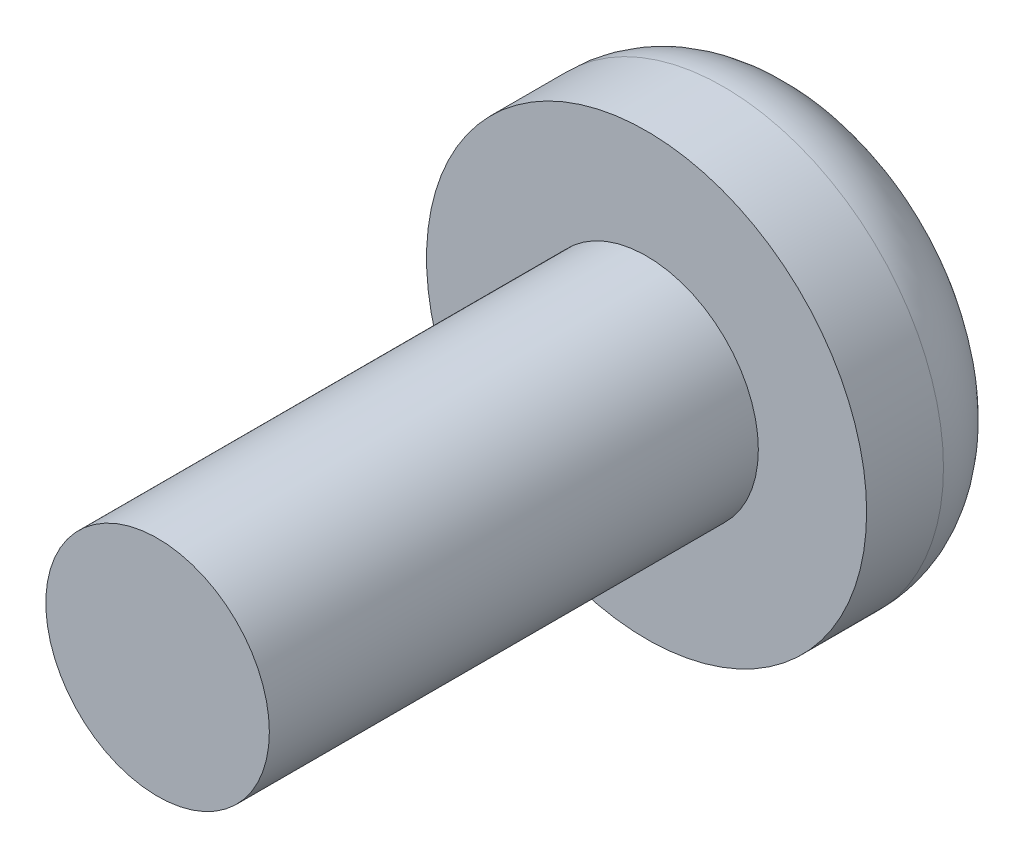
ISO-10303-21;
HEADER;
FILE_DESCRIPTION(('STEP AP214'),'2;1');
FILE_NAME('part.step','',(''),(''),'','','');
FILE_SCHEMA(('AUTOMOTIVE_DESIGN { 1 0 10303 214 1 1 1 1 }'));
ENDSEC;
DATA;
#1=APPLICATION_CONTEXT('core data for automotive mechanical design processes');
#2=APPLICATION_PROTOCOL_DEFINITION('international standard','automotive_design',2000,#1);
#3=PRODUCT_CONTEXT('',#1,'mechanical');
#4=PRODUCT('Part','Part','',(#3));
#5=PRODUCT_RELATED_PRODUCT_CATEGORY('part','',(#4));
#6=PRODUCT_DEFINITION_FORMATION('','',#4);
#7=PRODUCT_DEFINITION_CONTEXT('part definition',#1,'design');
#8=PRODUCT_DEFINITION('design','',#6,#7);
#9=PRODUCT_DEFINITION_SHAPE('','',#8);
#10=(LENGTH_UNIT() NAMED_UNIT(*) SI_UNIT(.MILLI.,.METRE.));
#11=(NAMED_UNIT(*) PLANE_ANGLE_UNIT() SI_UNIT($,.RADIAN.));
#12=(NAMED_UNIT(*) SI_UNIT($,.STERADIAN.) SOLID_ANGLE_UNIT());
#13=UNCERTAINTY_MEASURE_WITH_UNIT(LENGTH_MEASURE(1.E-05),#10,'distance_accuracy_value','');
#14=(GEOMETRIC_REPRESENTATION_CONTEXT(3) GLOBAL_UNCERTAINTY_ASSIGNED_CONTEXT((#13)) GLOBAL_UNIT_ASSIGNED_CONTEXT((#10,
#11,#12)) REPRESENTATION_CONTEXT('',''));
#15=CARTESIAN_POINT('',(0.,0.,0.));
#16=DIRECTION('',(0.,0.,1.));
#17=DIRECTION('',(1.,0.,0.));
#18=AXIS2_PLACEMENT_3D('',#15,#16,#17);
#19=CARTESIAN_POINT('',(0.,0.,0.));
#20=DIRECTION('',(0.,0.,1.));
#21=DIRECTION('',(1.,0.,0.));
#22=AXIS2_PLACEMENT_3D('',#19,#20,#21);
#23=PLANE('',#22);
#24=DIRECTION('',(1.,0.,0.));
#25=VECTOR('',#24,1.);
#26=CARTESIAN_POINT('',(-2.457284940462,0.307900911623638,0.));
#27=LINE('',#26,#25);
#28=CARTESIAN_POINT('',(0.307900911623639,0.307900911623638,0.));
#29=VERTEX_POINT('',#28);
#30=CARTESIAN_POINT('',(2.457284940462,0.307900911623638,0.));
#31=VERTEX_POINT('',#30);
#32=EDGE_CURVE('E202',#29,#31,#27,.T.);
#33=ORIENTED_EDGE('',*,*,#32,.F.);
#34=DIRECTION('',(0.,-1.,0.));
#35=VECTOR('',#34,1.);
#36=CARTESIAN_POINT('',(0.307900911623646,2.457284940462,0.));
#37=LINE('',#36,#35);
#38=CARTESIAN_POINT('',(0.307900911623646,2.457284940462,0.));
#39=VERTEX_POINT('',#38);
#40=EDGE_CURVE('E149',#39,#29,#37,.T.);
#41=ORIENTED_EDGE('',*,*,#40,.F.);
#42=CARTESIAN_POINT('',(0.,0.,0.));
#43=DIRECTION('',(0.,0.,1.));
#44=DIRECTION('',(1.,0.,0.));
#45=AXIS2_PLACEMENT_3D('',#42,#43,#44);
#46=CIRCLE('',#45,2.4765);
#47=EDGE_CURVE('E44',#39,#31,#46,.F.);
#48=ORIENTED_EDGE('',*,*,#47,.T.);
#49=EDGE_LOOP('',(#33,#41,#48));
#50=FACE_BOUND('',#49,.T.);
#51=ADVANCED_FACE('F35',(#50),#23,.F.);
#52=CARTESIAN_POINT('',(-0.307900911623629,2.457284940462,0.));
#53=VERTEX_POINT('',#52);
#54=EDGE_CURVE('E234',#53,#39,#46,.F.);
#55=ORIENTED_EDGE('',*,*,#54,.T.);
#56=DIRECTION('',(1.,0.,0.));
#57=VECTOR('',#56,1.);
#58=CARTESIAN_POINT('',(0.307900911623646,2.457284940462,0.));
#59=LINE('',#58,#57);
#60=EDGE_CURVE('E160',#53,#39,#59,.T.);
#61=ORIENTED_EDGE('',*,*,#60,.F.);
#62=EDGE_LOOP('',(#55,#61));
#63=FACE_BOUND('',#62,.T.);
#64=ADVANCED_FACE('F249',(#63),#23,.F.);
#65=CARTESIAN_POINT('',(2.457284940462,-0.307900911623636,0.));
#66=VERTEX_POINT('',#65);
#67=CARTESIAN_POINT('',(0.307900911623629,-2.457284940462,0.));
#68=VERTEX_POINT('',#67);
#69=EDGE_CURVE('E11',#66,#68,#46,.F.);
#70=ORIENTED_EDGE('',*,*,#69,.T.);
#71=CARTESIAN_POINT('',(0.307900911623636,-0.307900911623638,0.));
#72=VERTEX_POINT('',#71);
#73=EDGE_CURVE('E151',#72,#68,#37,.T.);
#74=ORIENTED_EDGE('',*,*,#73,.F.);
#75=DIRECTION('',(-1.,0.,0.));
#76=VECTOR('',#75,1.);
#77=CARTESIAN_POINT('',(-2.457284940462,-0.307900911623638,0.));
#78=LINE('',#77,#76);
#79=EDGE_CURVE('E196',#66,#72,#78,.T.);
#80=ORIENTED_EDGE('',*,*,#79,.F.);
#81=EDGE_LOOP('',(#70,#74,#80));
#82=FACE_BOUND('',#81,.T.);
#83=ADVANCED_FACE('F272',(#82),#23,.F.);
#84=CARTESIAN_POINT('',(-0.307900911623646,-2.457284940462,0.));
#85=VERTEX_POINT('',#84);
#86=EDGE_CURVE('E43',#68,#85,#46,.F.);
#87=ORIENTED_EDGE('',*,*,#86,.T.);
#88=DIRECTION('',(-1.,0.,0.));
#89=VECTOR('',#88,1.);
#90=CARTESIAN_POINT('',(0.307900911623629,-2.457284940462,0.));
#91=LINE('',#90,#89);
#92=EDGE_CURVE('E132',#68,#85,#91,.T.);
#93=ORIENTED_EDGE('',*,*,#92,.F.);
#94=EDGE_LOOP('',(#87,#93));
#95=FACE_BOUND('',#94,.T.);
#96=ADVANCED_FACE('F283',(#95),#23,.F.);
#97=CARTESIAN_POINT('',(-2.457284940462,0.307900911623638,1.016));
#98=DIRECTION('',(0.,1.,0.));
#99=DIRECTION('',(0.,0.,1.));
#100=AXIS2_PLACEMENT_3D('',#97,#98,#99);
#101=PLANE('',#100);
#102=DIRECTION('',(1.,0.,0.));
#103=VECTOR('',#102,1.);
#104=CARTESIAN_POINT('',(-2.457284940462,0.307900911623638,1.016));
#105=LINE('',#104,#103);
#106=CARTESIAN_POINT('',(0.307900911623638,0.307900911623638,1.016));
#107=VERTEX_POINT('',#106);
#108=CARTESIAN_POINT('',(2.457284940462,0.307900911623638,1.016));
#109=VERTEX_POINT('',#108);
#110=EDGE_CURVE('E190',#107,#109,#105,.T.);
#111=ORIENTED_EDGE('',*,*,#110,.F.);
#112=DIRECTION('',(0.,0.,-1.));
#113=VECTOR('',#112,1.);
#114=CARTESIAN_POINT('',(0.307900911623639,0.307900911623638,1.016));
#115=LINE('',#114,#113);
#116=EDGE_CURVE('E176',#107,#29,#115,.T.);
#117=ORIENTED_EDGE('',*,*,#116,.T.);
#118=ORIENTED_EDGE('',*,*,#32,.T.);
#119=DIRECTION('',(0.,0.,-1.));
#120=VECTOR('',#119,1.);
#121=CARTESIAN_POINT('',(2.457284940462,0.307900911623638,1.016));
#122=LINE('',#121,#120);
#123=EDGE_CURVE('E205',#109,#31,#122,.T.);
#124=ORIENTED_EDGE('',*,*,#123,.F.);
#125=EDGE_LOOP('',(#111,#117,#118,#124));
#126=FACE_BOUND('',#125,.T.);
#127=ADVANCED_FACE('F288',(#126),#101,.F.);
#128=CARTESIAN_POINT('',(-2.457284940462,-0.307900911623638,1.016));
#129=DIRECTION('',(0.,-1.,0.));
#130=DIRECTION('',(0.,0.,-1.));
#131=AXIS2_PLACEMENT_3D('',#128,#129,#130);
#132=PLANE('',#131);
#133=ORIENTED_EDGE('',*,*,#79,.T.);
#134=DIRECTION('',(0.,0.,1.));
#135=VECTOR('',#134,1.);
#136=CARTESIAN_POINT('',(0.307900911623637,-0.307900911623638,1.016));
#137=LINE('',#136,#135);
#138=CARTESIAN_POINT('',(0.307900911623636,-0.307900911623638,1.016));
#139=VERTEX_POINT('',#138);
#140=EDGE_CURVE('E173',#72,#139,#137,.T.);
#141=ORIENTED_EDGE('',*,*,#140,.T.);
#142=DIRECTION('',(-1.,0.,0.));
#143=VECTOR('',#142,1.);
#144=CARTESIAN_POINT('',(-2.457284940462,-0.307900911623638,1.016));
#145=LINE('',#144,#143);
#146=CARTESIAN_POINT('',(2.457284940462,-0.307900911623638,1.016));
#147=VERTEX_POINT('',#146);
#148=EDGE_CURVE('E185',#147,#139,#145,.T.);
#149=ORIENTED_EDGE('',*,*,#148,.F.);
#150=DIRECTION('',(0.,0.,-1.));
#151=VECTOR('',#150,1.);
#152=CARTESIAN_POINT('',(2.457284940462,-0.307900911623638,1.016));
#153=LINE('',#152,#151);
#154=EDGE_CURVE('E193',#147,#66,#153,.T.);
#155=ORIENTED_EDGE('',*,*,#154,.T.);
#156=EDGE_LOOP('',(#133,#141,#149,#155));
#157=FACE_BOUND('',#156,.T.);
#158=ADVANCED_FACE('F274',(#157),#132,.F.);
#159=EDGE_CURVE('E225',#31,#66,#46,.F.);
#160=ORIENTED_EDGE('',*,*,#159,.T.);
#161=DIRECTION('',(0.,-1.,0.));
#162=VECTOR('',#161,1.);
#163=CARTESIAN_POINT('',(2.457284940462,0.307900911623638,0.));
#164=LINE('',#163,#162);
#165=EDGE_CURVE('E179',#31,#66,#164,.T.);
#166=ORIENTED_EDGE('',*,*,#165,.F.);
#167=EDGE_LOOP('',(#160,#166));
#168=FACE_BOUND('',#167,.T.);
#169=ADVANCED_FACE('F280',(#168),#23,.F.);
#170=CARTESIAN_POINT('',(-2.457284940462,0.307900911623638,0.));
#171=VERTEX_POINT('',#170);
#172=EDGE_CURVE('E229',#171,#53,#46,.F.);
#173=ORIENTED_EDGE('',*,*,#172,.T.);
#174=DIRECTION('',(0.,1.,0.));
#175=VECTOR('',#174,1.);
#176=CARTESIAN_POINT('',(-0.307900911623629,2.457284940462,0.));
#177=LINE('',#176,#175);
#178=CARTESIAN_POINT('',(-0.307900911623636,0.307900911623638,0.));
#179=VERTEX_POINT('',#178);
#180=EDGE_CURVE('E157',#179,#53,#177,.T.);
#181=ORIENTED_EDGE('',*,*,#180,.F.);
#182=EDGE_CURVE('E184',#171,#179,#27,.T.);
#183=ORIENTED_EDGE('',*,*,#182,.F.);
#184=EDGE_LOOP('',(#173,#181,#183));
#185=FACE_BOUND('',#184,.T.);
#186=ADVANCED_FACE('F258',(#185),#23,.F.);
#187=CARTESIAN_POINT('',(-2.457284940462,-0.307900911623638,0.));
#188=VERTEX_POINT('',#187);
#189=EDGE_CURVE('E45',#188,#171,#46,.F.);
#190=ORIENTED_EDGE('',*,*,#189,.T.);
#191=DIRECTION('',(0.,1.,0.));
#192=VECTOR('',#191,1.);
#193=CARTESIAN_POINT('',(-2.457284940462,0.307900911623638,0.));
#194=LINE('',#193,#192);
#195=EDGE_CURVE('E199',#188,#171,#194,.T.);
#196=ORIENTED_EDGE('',*,*,#195,.F.);
#197=EDGE_LOOP('',(#190,#196));
#198=FACE_BOUND('',#197,.T.);
#199=ADVANCED_FACE('F268',(#198),#23,.F.);
#200=CARTESIAN_POINT('',(0.,0.,2.921));
#201=DIRECTION('',(0.,0.,1.));
#202=DIRECTION('',(1.,0.,0.));
#203=AXIS2_PLACEMENT_3D('',#200,#201,#202);
#204=PLANE('',#203);
#205=CARTESIAN_POINT('',(0.,0.,2.921));
#206=DIRECTION('',(0.,0.,1.));
#207=DIRECTION('',(1.,0.,0.));
#208=AXIS2_PLACEMENT_3D('',#205,#206,#207);
#209=CIRCLE('',#208,4.0005);
#210=CARTESIAN_POINT('',(4.0005,0.,2.921));
#211=VERTEX_POINT('',#210);
#212=EDGE_CURVE('E219',#211,#211,#209,.T.);
#213=ORIENTED_EDGE('',*,*,#212,.T.);
#214=EDGE_LOOP('',(#213));
#215=FACE_BOUND('',#214,.T.);
#216=CARTESIAN_POINT('',(0.,0.,2.921));
#217=DIRECTION('',(0.,0.,1.));
#218=DIRECTION('',(1.,0.,0.));
#219=AXIS2_PLACEMENT_3D('',#216,#217,#218);
#220=CIRCLE('',#219,2.032);
#221=CARTESIAN_POINT('',(2.032,0.,2.921));
#222=VERTEX_POINT('',#221);
#223=EDGE_CURVE('E208',#222,#222,#220,.T.);
#224=ORIENTED_EDGE('',*,*,#223,.F.);
#225=EDGE_LOOP('',(#224));
#226=FACE_BOUND('',#225,.T.);
#227=ADVANCED_FACE('F307',(#215,#226),#204,.T.);
#228=CARTESIAN_POINT('',(0.,0.,2.921));
#229=DIRECTION('',(0.,0.,-1.));
#230=DIRECTION('',(-1.,0.,0.));
#231=AXIS2_PLACEMENT_3D('',#228,#229,#230);
#232=CYLINDRICAL_SURFACE('',#231,4.0005);
#233=CARTESIAN_POINT('',(0.,0.,1.524));
#234=DIRECTION('',(0.,0.,1.));
#235=DIRECTION('',(1.,0.,0.));
#236=AXIS2_PLACEMENT_3D('',#233,#234,#235);
#237=CIRCLE('',#236,4.0005);
#238=CARTESIAN_POINT('',(4.0005,0.,1.524));
#239=VERTEX_POINT('',#238);
#240=EDGE_CURVE('E223',#239,#239,#237,.T.);
#241=ORIENTED_EDGE('',*,*,#240,.T.);
#242=EDGE_LOOP('',(#241));
#243=FACE_BOUND('',#242,.T.);
#244=ORIENTED_EDGE('',*,*,#212,.F.);
#245=EDGE_LOOP('',(#244));
#246=FACE_BOUND('',#245,.T.);
#247=ADVANCED_FACE('F301',(#243,#246),#232,.T.);
#248=CARTESIAN_POINT('',(-0.307900911623639,-0.307900911623638,0.));
#249=VERTEX_POINT('',#248);
#250=EDGE_CURVE('E195',#249,#188,#78,.T.);
#251=ORIENTED_EDGE('',*,*,#250,.F.);
#252=EDGE_CURVE('E158',#85,#249,#177,.T.);
#253=ORIENTED_EDGE('',*,*,#252,.F.);
#254=EDGE_CURVE('E237',#85,#188,#46,.F.);
#255=ORIENTED_EDGE('',*,*,#254,.T.);
#256=EDGE_LOOP('',(#251,#253,#255));
#257=FACE_BOUND('',#256,.T.);
#258=ADVANCED_FACE('F291',(#257),#23,.F.);
#259=CARTESIAN_POINT('',(0.,0.,1.524));
#260=DIRECTION('',(0.,0.,1.));
#261=DIRECTION('',(1.,0.,0.));
#262=AXIS2_PLACEMENT_3D('',#259,#260,#261);
#263=TOROIDAL_SURFACE('',#262,2.4765,1.524);
#264=ORIENTED_EDGE('',*,*,#69,.F.);
#265=ORIENTED_EDGE('',*,*,#159,.F.);
#266=ORIENTED_EDGE('',*,*,#47,.F.);
#267=ORIENTED_EDGE('',*,*,#54,.F.);
#268=ORIENTED_EDGE('',*,*,#172,.F.);
#269=ORIENTED_EDGE('',*,*,#189,.F.);
#270=ORIENTED_EDGE('',*,*,#254,.F.);
#271=ORIENTED_EDGE('',*,*,#86,.F.);
#272=EDGE_LOOP('',(#264,#265,#266,#267,#268,#269,#270,#271));
#273=FACE_BOUND('',#272,.T.);
#274=ORIENTED_EDGE('',*,*,#240,.F.);
#275=EDGE_LOOP('',(#274));
#276=FACE_BOUND('',#275,.T.);
#277=ADVANCED_FACE('F37',(#273,#276),#263,.T.);
#278=CARTESIAN_POINT('',(0.,0.,11.811));
#279=DIRECTION('',(0.,0.,-1.));
#280=DIRECTION('',(-1.,0.,0.));
#281=AXIS2_PLACEMENT_3D('',#278,#279,#280);
#282=CYLINDRICAL_SURFACE('',#281,2.032);
#283=CARTESIAN_POINT('',(0.,0.,11.811));
#284=DIRECTION('',(0.,0.,1.));
#285=DIRECTION('',(1.,0.,0.));
#286=AXIS2_PLACEMENT_3D('',#283,#284,#285);
#287=CIRCLE('',#286,2.032);
#288=CARTESIAN_POINT('',(2.032,0.,11.811));
#289=VERTEX_POINT('',#288);
#290=EDGE_CURVE('E216',#289,#289,#287,.T.);
#291=ORIENTED_EDGE('',*,*,#290,.F.);
#292=EDGE_LOOP('',(#291));
#293=FACE_BOUND('',#292,.T.);
#294=ORIENTED_EDGE('',*,*,#223,.T.);
#295=EDGE_LOOP('',(#294));
#296=FACE_BOUND('',#295,.T.);
#297=ADVANCED_FACE('F306',(#293,#296),#282,.T.);
#298=CARTESIAN_POINT('',(0.,0.,11.811));
#299=DIRECTION('',(0.,0.,1.));
#300=DIRECTION('',(1.,0.,0.));
#301=AXIS2_PLACEMENT_3D('',#298,#299,#300);
#302=PLANE('',#301);
#303=ORIENTED_EDGE('',*,*,#290,.T.);
#304=EDGE_LOOP('',(#303));
#305=FACE_BOUND('',#304,.T.);
#306=ADVANCED_FACE('F319',(#305),#302,.T.);
#307=CARTESIAN_POINT('',(2.457284940462,0.307900911623638,1.016));
#308=DIRECTION('',(1.,0.,0.));
#309=DIRECTION('',(0.,0.,-1.));
#310=AXIS2_PLACEMENT_3D('',#307,#308,#309);
#311=PLANE('',#310);
#312=ORIENTED_EDGE('',*,*,#165,.T.);
#313=ORIENTED_EDGE('',*,*,#154,.F.);
#314=DIRECTION('',(0.,-1.,0.));
#315=VECTOR('',#314,1.);
#316=CARTESIAN_POINT('',(2.457284940462,0.307900911623638,1.016));
#317=LINE('',#316,#315);
#318=EDGE_CURVE('E180',#109,#147,#317,.T.);
#319=ORIENTED_EDGE('',*,*,#318,.F.);
#320=ORIENTED_EDGE('',*,*,#123,.T.);
#321=EDGE_LOOP('',(#312,#313,#319,#320));
#322=FACE_BOUND('',#321,.T.);
#323=ADVANCED_FACE('F278',(#322),#311,.F.);
#324=ORIENTED_EDGE('',*,*,#182,.T.);
#325=DIRECTION('',(0.,0.,1.));
#326=VECTOR('',#325,1.);
#327=CARTESIAN_POINT('',(-0.307900911623636,0.307900911623638,1.016));
#328=LINE('',#327,#326);
#329=CARTESIAN_POINT('',(-0.307900911623636,0.307900911623638,1.016));
#330=VERTEX_POINT('',#329);
#331=EDGE_CURVE('E170',#179,#330,#328,.T.);
#332=ORIENTED_EDGE('',*,*,#331,.T.);
#333=CARTESIAN_POINT('',(-2.457284940462,0.307900911623638,1.016));
#334=VERTEX_POINT('',#333);
#335=EDGE_CURVE('E191',#334,#330,#105,.T.);
#336=ORIENTED_EDGE('',*,*,#335,.F.);
#337=DIRECTION('',(0.,0.,-1.));
#338=VECTOR('',#337,1.);
#339=CARTESIAN_POINT('',(-2.457284940462,0.307900911623638,1.016));
#340=LINE('',#339,#338);
#341=EDGE_CURVE('E209',#334,#171,#340,.T.);
#342=ORIENTED_EDGE('',*,*,#341,.T.);
#343=EDGE_LOOP('',(#324,#332,#336,#342));
#344=FACE_BOUND('',#343,.T.);
#345=ADVANCED_FACE('F260',(#344),#101,.F.);
#346=CARTESIAN_POINT('',(-2.457284940462,0.307900911623638,1.016));
#347=DIRECTION('',(-1.,0.,0.));
#348=DIRECTION('',(0.,0.,1.));
#349=AXIS2_PLACEMENT_3D('',#346,#347,#348);
#350=PLANE('',#349);
#351=ORIENTED_EDGE('',*,*,#195,.T.);
#352=ORIENTED_EDGE('',*,*,#341,.F.);
#353=DIRECTION('',(0.,1.,0.));
#354=VECTOR('',#353,1.);
#355=CARTESIAN_POINT('',(-2.457284940462,0.307900911623638,1.016));
#356=LINE('',#355,#354);
#357=CARTESIAN_POINT('',(-2.457284940462,-0.307900911623638,1.016));
#358=VERTEX_POINT('',#357);
#359=EDGE_CURVE('E187',#358,#334,#356,.T.);
#360=ORIENTED_EDGE('',*,*,#359,.F.);
#361=DIRECTION('',(0.,0.,-1.));
#362=VECTOR('',#361,1.);
#363=CARTESIAN_POINT('',(-2.457284940462,-0.307900911623638,1.016));
#364=LINE('',#363,#362);
#365=EDGE_CURVE('E211',#358,#188,#364,.T.);
#366=ORIENTED_EDGE('',*,*,#365,.T.);
#367=EDGE_LOOP('',(#351,#352,#360,#366));
#368=FACE_BOUND('',#367,.T.);
#369=ADVANCED_FACE('F265',(#368),#350,.F.);
#370=CARTESIAN_POINT('',(-0.307900911623637,-0.307900911623638,1.016));
#371=VERTEX_POINT('',#370);
#372=EDGE_CURVE('E183',#371,#358,#145,.T.);
#373=ORIENTED_EDGE('',*,*,#372,.F.);
#374=DIRECTION('',(0.,0.,-1.));
#375=VECTOR('',#374,1.);
#376=CARTESIAN_POINT('',(-0.307900911623638,-0.307900911623638,1.016));
#377=LINE('',#376,#375);
#378=EDGE_CURVE('E139',#371,#249,#377,.T.);
#379=ORIENTED_EDGE('',*,*,#378,.T.);
#380=ORIENTED_EDGE('',*,*,#250,.T.);
#381=ORIENTED_EDGE('',*,*,#365,.F.);
#382=EDGE_LOOP('',(#373,#379,#380,#381));
#383=FACE_BOUND('',#382,.T.);
#384=ADVANCED_FACE('F290',(#383),#132,.F.);
#385=CARTESIAN_POINT('',(2.457284940462,-0.307900911623638,1.016));
#386=DIRECTION('',(0.,0.,1.));
#387=DIRECTION('',(1.,0.,0.));
#388=AXIS2_PLACEMENT_3D('',#385,#386,#387);
#389=PLANE('',#388);
#390=ORIENTED_EDGE('',*,*,#335,.T.);
#391=DIRECTION('',(0.,1.,0.));
#392=VECTOR('',#391,1.);
#393=CARTESIAN_POINT('',(-0.307900911623629,2.457284940462,1.016));
#394=LINE('',#393,#392);
#395=CARTESIAN_POINT('',(-0.307900911623629,2.457284940462,1.016));
#396=VERTEX_POINT('',#395);
#397=EDGE_CURVE('E142',#330,#396,#394,.T.);
#398=ORIENTED_EDGE('',*,*,#397,.T.);
#399=DIRECTION('',(1.,0.,0.));
#400=VECTOR('',#399,1.);
#401=CARTESIAN_POINT('',(0.307900911623646,2.457284940462,1.016));
#402=LINE('',#401,#400);
#403=CARTESIAN_POINT('',(0.307900911623646,2.457284940462,1.016));
#404=VERTEX_POINT('',#403);
#405=EDGE_CURVE('E141',#396,#404,#402,.T.);
#406=ORIENTED_EDGE('',*,*,#405,.T.);
#407=DIRECTION('',(0.,-1.,0.));
#408=VECTOR('',#407,1.);
#409=CARTESIAN_POINT('',(0.307900911623646,2.457284940462,1.016));
#410=LINE('',#409,#408);
#411=EDGE_CURVE('E52',#404,#107,#410,.T.);
#412=ORIENTED_EDGE('',*,*,#411,.T.);
#413=ORIENTED_EDGE('',*,*,#110,.T.);
#414=ORIENTED_EDGE('',*,*,#318,.T.);
#415=ORIENTED_EDGE('',*,*,#148,.T.);
#416=CARTESIAN_POINT('',(0.307900911623629,-2.457284940462,1.016));
#417=VERTEX_POINT('',#416);
#418=EDGE_CURVE('E147',#139,#417,#410,.T.);
#419=ORIENTED_EDGE('',*,*,#418,.T.);
#420=DIRECTION('',(-1.,0.,0.));
#421=VECTOR('',#420,1.);
#422=CARTESIAN_POINT('',(0.307900911623629,-2.457284940462,1.016));
#423=LINE('',#422,#421);
#424=CARTESIAN_POINT('',(-0.307900911623646,-2.457284940462,1.016));
#425=VERTEX_POINT('',#424);
#426=EDGE_CURVE('E130',#417,#425,#423,.T.);
#427=ORIENTED_EDGE('',*,*,#426,.T.);
#428=EDGE_CURVE('E59',#425,#371,#394,.T.);
#429=ORIENTED_EDGE('',*,*,#428,.T.);
#430=ORIENTED_EDGE('',*,*,#372,.T.);
#431=ORIENTED_EDGE('',*,*,#359,.T.);
#432=EDGE_LOOP('',(#390,#398,#406,#412,#413,#414,#415,#419,#427,#429,#430,#431));
#433=FACE_BOUND('',#432,.T.);
#434=ADVANCED_FACE('F145',(#433),#389,.F.);
#435=CARTESIAN_POINT('',(-0.307900911623629,2.457284940462,1.016));
#436=DIRECTION('',(-1.,0.,0.));
#437=DIRECTION('',(0.,-1.,0.));
#438=AXIS2_PLACEMENT_3D('',#435,#436,#437);
#439=PLANE('',#438);
#440=ORIENTED_EDGE('',*,*,#428,.F.);
#441=DIRECTION('',(0.,0.,-1.));
#442=VECTOR('',#441,1.);
#443=CARTESIAN_POINT('',(-0.307900911623646,-2.457284940462,1.016));
#444=LINE('',#443,#442);
#445=EDGE_CURVE('E127',#425,#85,#444,.T.);
#446=ORIENTED_EDGE('',*,*,#445,.T.);
#447=ORIENTED_EDGE('',*,*,#252,.T.);
#448=ORIENTED_EDGE('',*,*,#378,.F.);
#449=EDGE_LOOP('',(#440,#446,#447,#448));
#450=FACE_BOUND('',#449,.T.);
#451=ADVANCED_FACE('F137',(#450),#439,.F.);
#452=CARTESIAN_POINT('',(0.307900911623646,2.457284940462,1.016));
#453=DIRECTION('',(1.,0.,0.));
#454=DIRECTION('',(0.,1.,0.));
#455=AXIS2_PLACEMENT_3D('',#452,#453,#454);
#456=PLANE('',#455);
#457=ORIENTED_EDGE('',*,*,#73,.T.);
#458=DIRECTION('',(0.,0.,-1.));
#459=VECTOR('',#458,1.);
#460=CARTESIAN_POINT('',(0.307900911623629,-2.457284940462,1.016));
#461=LINE('',#460,#459);
#462=EDGE_CURVE('E163',#417,#68,#461,.T.);
#463=ORIENTED_EDGE('',*,*,#462,.F.);
#464=ORIENTED_EDGE('',*,*,#418,.F.);
#465=ORIENTED_EDGE('',*,*,#140,.F.);
#466=EDGE_LOOP('',(#457,#463,#464,#465));
#467=FACE_BOUND('',#466,.T.);
#468=ADVANCED_FACE('F337',(#467),#456,.F.);
#469=CARTESIAN_POINT('',(0.307900911623629,-2.457284940462,1.016));
#470=DIRECTION('',(0.,-1.,0.));
#471=DIRECTION('',(1.,0.,0.));
#472=AXIS2_PLACEMENT_3D('',#469,#470,#471);
#473=PLANE('',#472);
#474=ORIENTED_EDGE('',*,*,#92,.T.);
#475=ORIENTED_EDGE('',*,*,#445,.F.);
#476=ORIENTED_EDGE('',*,*,#426,.F.);
#477=ORIENTED_EDGE('',*,*,#462,.T.);
#478=EDGE_LOOP('',(#474,#475,#476,#477));
#479=FACE_BOUND('',#478,.T.);
#480=ADVANCED_FACE('F128',(#479),#473,.F.);
#481=ORIENTED_EDGE('',*,*,#411,.F.);
#482=DIRECTION('',(0.,0.,-1.));
#483=VECTOR('',#482,1.);
#484=CARTESIAN_POINT('',(0.307900911623646,2.457284940462,1.016));
#485=LINE('',#484,#483);
#486=EDGE_CURVE('E165',#404,#39,#485,.T.);
#487=ORIENTED_EDGE('',*,*,#486,.T.);
#488=ORIENTED_EDGE('',*,*,#40,.T.);
#489=ORIENTED_EDGE('',*,*,#116,.F.);
#490=EDGE_LOOP('',(#481,#487,#488,#489));
#491=FACE_BOUND('',#490,.T.);
#492=ADVANCED_FACE('F336',(#491),#456,.F.);
#493=ORIENTED_EDGE('',*,*,#180,.T.);
#494=DIRECTION('',(0.,0.,-1.));
#495=VECTOR('',#494,1.);
#496=CARTESIAN_POINT('',(-0.307900911623629,2.457284940462,1.016));
#497=LINE('',#496,#495);
#498=EDGE_CURVE('E135',#396,#53,#497,.T.);
#499=ORIENTED_EDGE('',*,*,#498,.F.);
#500=ORIENTED_EDGE('',*,*,#397,.F.);
#501=ORIENTED_EDGE('',*,*,#331,.F.);
#502=EDGE_LOOP('',(#493,#499,#500,#501));
#503=FACE_BOUND('',#502,.T.);
#504=ADVANCED_FACE('F338',(#503),#439,.F.);
#505=CARTESIAN_POINT('',(0.307900911623646,2.457284940462,1.016));
#506=DIRECTION('',(0.,1.,0.));
#507=DIRECTION('',(-1.,0.,0.));
#508=AXIS2_PLACEMENT_3D('',#505,#506,#507);
#509=PLANE('',#508);
#510=ORIENTED_EDGE('',*,*,#60,.T.);
#511=ORIENTED_EDGE('',*,*,#486,.F.);
#512=ORIENTED_EDGE('',*,*,#405,.F.);
#513=ORIENTED_EDGE('',*,*,#498,.T.);
#514=EDGE_LOOP('',(#510,#511,#512,#513));
#515=FACE_BOUND('',#514,.T.);
#516=ADVANCED_FACE('F341',(#515),#509,.F.);
#517=CLOSED_SHELL('',(#51,#64,#83,#96,#127,#158,#169,#186,#199,#227,#247,#258,#277,#297,#306,
#323,#345,#369,#384,#434,#451,#468,#480,#492,#504,#516));
#518=MANIFOLD_SOLID_BREP('B2',#517);
#519=ADVANCED_BREP_SHAPE_REPRESENTATION('',(#18,#518),#14);
#520=SHAPE_DEFINITION_REPRESENTATION(#9,#519);
ENDSEC;
END-ISO-10303-21;
